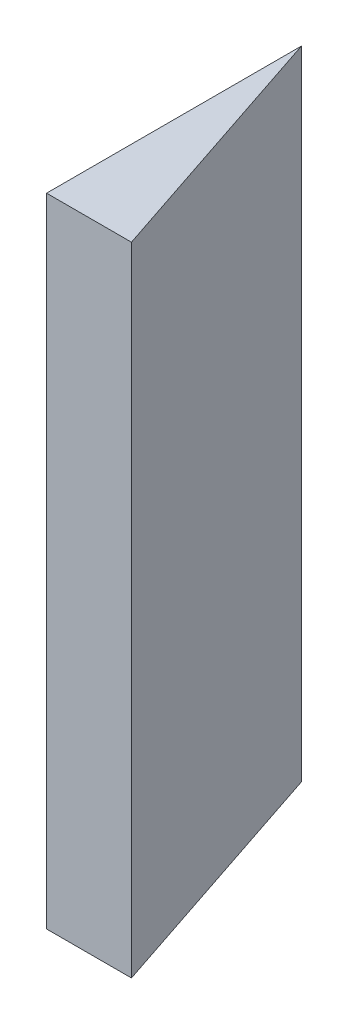
ISO-10303-21;
HEADER;
FILE_DESCRIPTION(('STEP AP214'),'2;1');
FILE_NAME('part.step','',(''),(''),'','','');
FILE_SCHEMA(('AUTOMOTIVE_DESIGN { 1 0 10303 214 1 1 1 1 }'));
ENDSEC;
DATA;
#1=APPLICATION_CONTEXT('core data for automotive mechanical design processes');
#2=APPLICATION_PROTOCOL_DEFINITION('international standard','automotive_design',2000,#1);
#3=PRODUCT_CONTEXT('',#1,'mechanical');
#4=PRODUCT('Part','Part','',(#3));
#5=PRODUCT_RELATED_PRODUCT_CATEGORY('part','',(#4));
#6=PRODUCT_DEFINITION_FORMATION('','',#4);
#7=PRODUCT_DEFINITION_CONTEXT('part definition',#1,'design');
#8=PRODUCT_DEFINITION('design','',#6,#7);
#9=PRODUCT_DEFINITION_SHAPE('','',#8);
#10=(LENGTH_UNIT() NAMED_UNIT(*) SI_UNIT(.MILLI.,.METRE.));
#11=(NAMED_UNIT(*) PLANE_ANGLE_UNIT() SI_UNIT($,.RADIAN.));
#12=(NAMED_UNIT(*) SI_UNIT($,.STERADIAN.) SOLID_ANGLE_UNIT());
#13=UNCERTAINTY_MEASURE_WITH_UNIT(LENGTH_MEASURE(1.E-05),#10,'distance_accuracy_value','');
#14=(GEOMETRIC_REPRESENTATION_CONTEXT(3) GLOBAL_UNCERTAINTY_ASSIGNED_CONTEXT((#13)) GLOBAL_UNIT_ASSIGNED_CONTEXT((#10,
#11,#12)) REPRESENTATION_CONTEXT('',''));
#15=CARTESIAN_POINT('',(0.,0.,0.));
#16=DIRECTION('',(0.,0.,1.));
#17=DIRECTION('',(1.,0.,0.));
#18=AXIS2_PLACEMENT_3D('',#15,#16,#17);
#19=CARTESIAN_POINT('',(-3.92,1.74999981815962,-3.67112136800623));
#20=DIRECTION('',(0.,-1.,-8.74227765734759E-08));
#21=DIRECTION('',(1.,0.,0.));
#22=AXIS2_PLACEMENT_3D('',#19,#20,#21);
#23=PLANE('',#22);
#24=DIRECTION('',(0.,8.74227767955201E-08,-0.999999999999996));
#25=VECTOR('',#24,1.);
#26=CARTESIAN_POINT('',(-3.9,1.74999978144206,-3.25112136800623));
#27=LINE('',#26,#25);
#28=CARTESIAN_POINT('',(-3.9,1.74999978144106,-3.25112136800623));
#29=VERTEX_POINT('',#28);
#30=CARTESIAN_POINT('',(-3.9,1.74999981641017,-3.65112136800623));
#31=VERTEX_POINT('',#30);
#32=EDGE_CURVE('E11',#29,#31,#27,.T.);
#33=ORIENTED_EDGE('',*,*,#32,.F.);
#34=DIRECTION('',(-1.,0.,0.));
#35=VECTOR('',#34,1.);
#36=CARTESIAN_POINT('',(-3.766777825356,1.74999978144206,-3.25112136800623));
#37=LINE('',#36,#35);
#38=CARTESIAN_POINT('',(-3.766777825356,1.74999978144106,-3.25112136800623));
#39=VERTEX_POINT('',#38);
#40=EDGE_CURVE('E63',#39,#29,#37,.T.);
#41=ORIENTED_EDGE('',*,*,#40,.F.);
#42=DIRECTION('',(0.315990463967206,-8.29434405337929E-08,0.948762365759616));
#43=VECTOR('',#42,1.);
#44=CARTESIAN_POINT('',(-3.9,1.74999981641117,-3.65112136800624));
#45=LINE('',#44,#43);
#46=EDGE_CURVE('E70',#31,#39,#45,.T.);
#47=ORIENTED_EDGE('',*,*,#46,.F.);
#48=EDGE_LOOP('',(#33,#41,#47));
#49=FACE_BOUND('',#48,.T.);
#50=ADVANCED_FACE('F17',(#49),#23,.F.);
#51=CARTESIAN_POINT('',(-3.92,0.749999818159625,-3.67112145542901));
#52=DIRECTION('',(0.,-1.,-8.74227765734759E-08));
#53=DIRECTION('',(1.,0.,0.));
#54=AXIS2_PLACEMENT_3D('',#51,#52,#53);
#55=PLANE('',#54);
#56=DIRECTION('',(0.315990463967206,-8.29434405337929E-08,0.948762365759616));
#57=VECTOR('',#56,1.);
#58=CARTESIAN_POINT('',(-3.9,0.749999816411169,-3.65112145542901));
#59=LINE('',#58,#57);
#60=CARTESIAN_POINT('',(-3.9,0.749999816412169,-3.65112145542901));
#61=VERTEX_POINT('',#60);
#62=CARTESIAN_POINT('',(-3.766777825356,0.749999781443059,-3.25112145542901));
#63=VERTEX_POINT('',#62);
#64=EDGE_CURVE('E24',#61,#63,#59,.T.);
#65=ORIENTED_EDGE('',*,*,#64,.T.);
#66=DIRECTION('',(-1.,0.,0.));
#67=VECTOR('',#66,1.);
#68=CARTESIAN_POINT('',(-3.766777825356,0.749999781442059,-3.25112145542901));
#69=LINE('',#68,#67);
#70=CARTESIAN_POINT('',(-3.9,0.749999781443059,-3.25112145542901));
#71=VERTEX_POINT('',#70);
#72=EDGE_CURVE('E49',#63,#71,#69,.T.);
#73=ORIENTED_EDGE('',*,*,#72,.T.);
#74=DIRECTION('',(0.,8.74227767955201E-08,-0.999999999999996));
#75=VECTOR('',#74,1.);
#76=CARTESIAN_POINT('',(-3.9,0.749999781442059,-3.25112145542901));
#77=LINE('',#76,#75);
#78=EDGE_CURVE('E46',#71,#61,#77,.T.);
#79=ORIENTED_EDGE('',*,*,#78,.T.);
#80=EDGE_LOOP('',(#65,#73,#79));
#81=FACE_BOUND('',#80,.T.);
#82=ADVANCED_FACE('F47',(#81),#55,.T.);
#83=CARTESIAN_POINT('',(-3.9,1.74999981641117,-3.65112136800623));
#84=DIRECTION('',(0.948762365759619,2.76247637570875E-08,-0.315990463967207));
#85=DIRECTION('',(0.315990463967207,-8.29434403231256E-08,0.948762365759619));
#86=AXIS2_PLACEMENT_3D('',#83,#84,#85);
#87=PLANE('',#86);
#88=ORIENTED_EDGE('',*,*,#46,.T.);
#89=DIRECTION('',(0.,-0.999999999999996,-8.74227765734755E-08));
#90=VECTOR('',#89,1.);
#91=CARTESIAN_POINT('',(-3.766777825356,1.74999978144206,-3.25112136800624));
#92=LINE('',#91,#90);
#93=EDGE_CURVE('E54',#39,#63,#92,.T.);
#94=ORIENTED_EDGE('',*,*,#93,.T.);
#95=ORIENTED_EDGE('',*,*,#64,.F.);
#96=DIRECTION('',(0.,-0.999999999999996,-8.74227765734755E-08));
#97=VECTOR('',#96,1.);
#98=CARTESIAN_POINT('',(-3.9,1.74999981641117,-3.65112136800624));
#99=LINE('',#98,#97);
#100=EDGE_CURVE('E61',#31,#61,#99,.T.);
#101=ORIENTED_EDGE('',*,*,#100,.F.);
#102=EDGE_LOOP('',(#88,#94,#95,#101));
#103=FACE_BOUND('',#102,.T.);
#104=ADVANCED_FACE('F60',(#103),#87,.T.);
#105=CARTESIAN_POINT('',(-3.766777825356,1.74999978144206,-3.25112136800623));
#106=DIRECTION('',(0.,-8.74227765734759E-08,1.));
#107=DIRECTION('',(-1.,0.,0.));
#108=AXIS2_PLACEMENT_3D('',#105,#106,#107);
#109=PLANE('',#108);
#110=ORIENTED_EDGE('',*,*,#40,.T.);
#111=DIRECTION('',(0.,-0.999999999999996,-8.74227765734755E-08));
#112=VECTOR('',#111,1.);
#113=CARTESIAN_POINT('',(-3.9,1.74999978144206,-3.25112136800623));
#114=LINE('',#113,#112);
#115=EDGE_CURVE('E55',#29,#71,#114,.T.);
#116=ORIENTED_EDGE('',*,*,#115,.T.);
#117=ORIENTED_EDGE('',*,*,#72,.F.);
#118=ORIENTED_EDGE('',*,*,#93,.F.);
#119=EDGE_LOOP('',(#110,#116,#117,#118));
#120=FACE_BOUND('',#119,.T.);
#121=ADVANCED_FACE('F73',(#120),#109,.T.);
#122=CARTESIAN_POINT('',(-3.9,1.74999978144206,-3.25112136800623));
#123=DIRECTION('',(-1.,0.,0.));
#124=DIRECTION('',(0.,8.74227765734759E-08,-1.));
#125=AXIS2_PLACEMENT_3D('',#122,#123,#124);
#126=PLANE('',#125);
#127=ORIENTED_EDGE('',*,*,#32,.T.);
#128=ORIENTED_EDGE('',*,*,#100,.T.);
#129=ORIENTED_EDGE('',*,*,#78,.F.);
#130=ORIENTED_EDGE('',*,*,#115,.F.);
#131=EDGE_LOOP('',(#127,#128,#129,#130));
#132=FACE_BOUND('',#131,.T.);
#133=ADVANCED_FACE('F64',(#132),#126,.T.);
#134=CLOSED_SHELL('',(#50,#82,#104,#121,#133));
#135=MANIFOLD_SOLID_BREP('B1',#134);
#136=ADVANCED_BREP_SHAPE_REPRESENTATION('',(#18,#135),#14);
#137=SHAPE_DEFINITION_REPRESENTATION(#9,#136);
ENDSEC;
END-ISO-10303-21;
